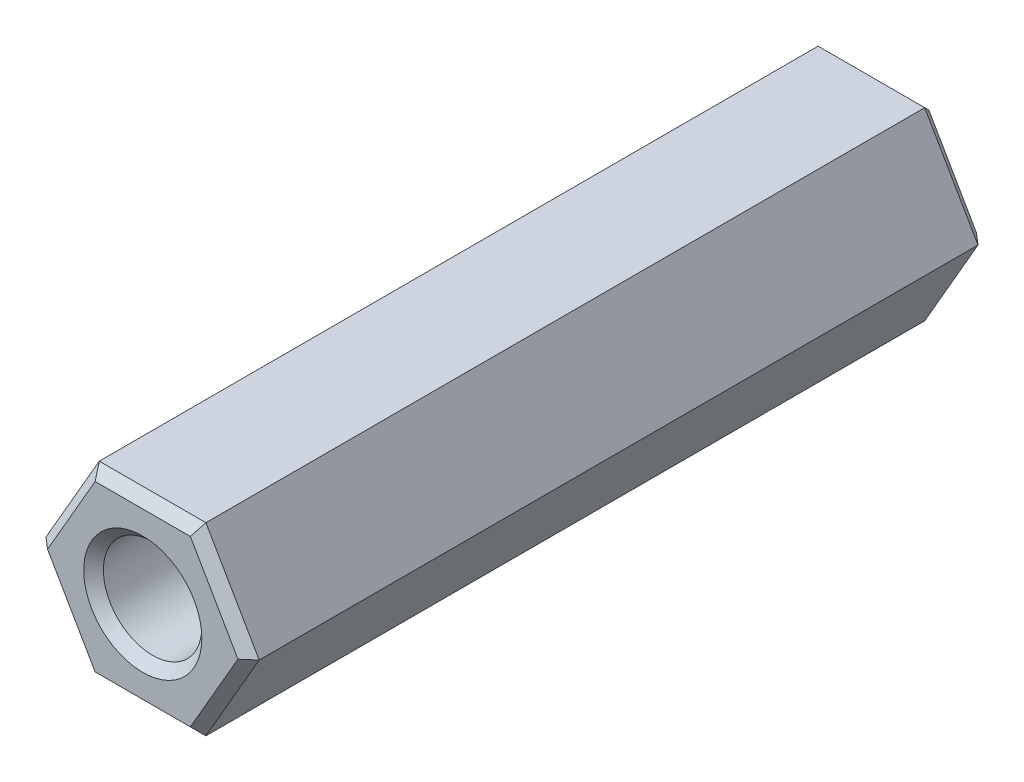
ISO-10303-21;
HEADER;
FILE_DESCRIPTION(('STEP AP214'),'2;1');
FILE_NAME('part.step','',(''),(''),'','','');
FILE_SCHEMA(('AUTOMOTIVE_DESIGN { 1 0 10303 214 1 1 1 1 }'));
ENDSEC;
DATA;
#1=APPLICATION_CONTEXT('core data for automotive mechanical design processes');
#2=APPLICATION_PROTOCOL_DEFINITION('international standard','automotive_design',2000,#1);
#3=PRODUCT_CONTEXT('',#1,'mechanical');
#4=PRODUCT('Part','Part','',(#3));
#5=PRODUCT_RELATED_PRODUCT_CATEGORY('part','',(#4));
#6=PRODUCT_DEFINITION_FORMATION('','',#4);
#7=PRODUCT_DEFINITION_CONTEXT('part definition',#1,'design');
#8=PRODUCT_DEFINITION('design','',#6,#7);
#9=PRODUCT_DEFINITION_SHAPE('','',#8);
#10=(LENGTH_UNIT() NAMED_UNIT(*) SI_UNIT(.MILLI.,.METRE.));
#11=(NAMED_UNIT(*) PLANE_ANGLE_UNIT() SI_UNIT($,.RADIAN.));
#12=(NAMED_UNIT(*) SI_UNIT($,.STERADIAN.) SOLID_ANGLE_UNIT());
#13=UNCERTAINTY_MEASURE_WITH_UNIT(LENGTH_MEASURE(1.E-05),#10,'distance_accuracy_value','');
#14=(GEOMETRIC_REPRESENTATION_CONTEXT(3) GLOBAL_UNCERTAINTY_ASSIGNED_CONTEXT((#13)) GLOBAL_UNIT_ASSIGNED_CONTEXT((#10,
#11,#12)) REPRESENTATION_CONTEXT('',''));
#15=CARTESIAN_POINT('',(0.,0.,0.));
#16=DIRECTION('',(0.,0.,1.));
#17=DIRECTION('',(1.,0.,0.));
#18=AXIS2_PLACEMENT_3D('',#15,#16,#17);
#19=CARTESIAN_POINT('',(-1.3748153285078,2.38125,-19.05));
#20=DIRECTION('',(-0.866025403784439,0.5,0.));
#21=DIRECTION('',(-0.5,-0.866025403784439,0.));
#22=AXIS2_PLACEMENT_3D('',#19,#20,#21);
#23=PLANE('',#22);
#24=DIRECTION('',(0.,0.,1.));
#25=VECTOR('',#24,1.);
#26=CARTESIAN_POINT('',(-2.74963065701559,0.,-19.05));
#27=LINE('',#26,#25);
#28=CARTESIAN_POINT('',(-2.7496306570156,0.,-0.254000000000016));
#29=VERTEX_POINT('',#28);
#30=CARTESIAN_POINT('',(-2.74963065701559,0.,-18.796));
#31=VERTEX_POINT('',#30);
#32=EDGE_CURVE('E134',#29,#31,#27,.F.);
#33=ORIENTED_EDGE('',*,*,#32,.F.);
#34=DIRECTION('',(0.499999999999999,0.866025403784439,0.));
#35=VECTOR('',#34,1.);
#36=CARTESIAN_POINT('',(-2.7496306570156,0.,-0.254000000000008));
#37=LINE('',#36,#35);
#38=CARTESIAN_POINT('',(-1.3748153285078,2.38125,-0.254000000000016));
#39=VERTEX_POINT('',#38);
#40=EDGE_CURVE('E104',#29,#39,#37,.T.);
#41=ORIENTED_EDGE('',*,*,#40,.T.);
#42=DIRECTION('',(0.,0.,1.));
#43=VECTOR('',#42,1.);
#44=CARTESIAN_POINT('',(-1.3748153285078,2.38125,-19.05));
#45=LINE('',#44,#43);
#46=CARTESIAN_POINT('',(-1.3748153285078,2.38125,-18.796));
#47=VERTEX_POINT('',#46);
#48=EDGE_CURVE('E111',#47,#39,#45,.T.);
#49=ORIENTED_EDGE('',*,*,#48,.F.);
#50=DIRECTION('',(0.499999999999999,0.866025403784439,0.));
#51=VECTOR('',#50,1.);
#52=CARTESIAN_POINT('',(-2.74963065701559,0.,-18.796));
#53=LINE('',#52,#51);
#54=EDGE_CURVE('E210',#31,#47,#53,.T.);
#55=ORIENTED_EDGE('',*,*,#54,.F.);
#56=EDGE_LOOP('',(#33,#41,#49,#55));
#57=FACE_BOUND('',#56,.T.);
#58=ADVANCED_FACE('F16',(#57),#23,.T.);
#59=CARTESIAN_POINT('',(-2.74963065701559,0.,-19.05));
#60=DIRECTION('',(-0.866025403784439,-0.5,0.));
#61=DIRECTION('',(0.5,-0.866025403784439,0.));
#62=AXIS2_PLACEMENT_3D('',#59,#60,#61);
#63=PLANE('',#62);
#64=DIRECTION('',(0.,0.,1.));
#65=VECTOR('',#64,1.);
#66=CARTESIAN_POINT('',(-1.3748153285078,-2.38125,-19.05));
#67=LINE('',#66,#65);
#68=CARTESIAN_POINT('',(-1.3748153285078,-2.38125,-0.254000000000016));
#69=VERTEX_POINT('',#68);
#70=CARTESIAN_POINT('',(-1.3748153285078,-2.38125,-18.796));
#71=VERTEX_POINT('',#70);
#72=EDGE_CURVE('E144',#69,#71,#67,.F.);
#73=ORIENTED_EDGE('',*,*,#72,.F.);
#74=DIRECTION('',(-0.499999999999999,0.866025403784439,0.));
#75=VECTOR('',#74,1.);
#76=CARTESIAN_POINT('',(-1.3748153285078,-2.38125,-0.254000000000011));
#77=LINE('',#76,#75);
#78=EDGE_CURVE('E132',#69,#29,#77,.T.);
#79=ORIENTED_EDGE('',*,*,#78,.T.);
#80=ORIENTED_EDGE('',*,*,#32,.T.);
#81=DIRECTION('',(-0.499999999999999,0.866025403784439,0.));
#82=VECTOR('',#81,1.);
#83=CARTESIAN_POINT('',(-1.3748153285078,-2.38125,-18.796));
#84=LINE('',#83,#82);
#85=EDGE_CURVE('E205',#71,#31,#84,.T.);
#86=ORIENTED_EDGE('',*,*,#85,.F.);
#87=EDGE_LOOP('',(#73,#79,#80,#86));
#88=FACE_BOUND('',#87,.T.);
#89=ADVANCED_FACE('F235',(#88),#63,.T.);
#90=CARTESIAN_POINT('',(-1.3748153285078,-2.38125,-19.05));
#91=DIRECTION('',(0.,-1.,0.));
#92=DIRECTION('',(1.,0.,0.));
#93=AXIS2_PLACEMENT_3D('',#90,#91,#92);
#94=PLANE('',#93);
#95=DIRECTION('',(0.,0.,1.));
#96=VECTOR('',#95,1.);
#97=CARTESIAN_POINT('',(1.3748153285078,-2.38125,-19.05));
#98=LINE('',#97,#96);
#99=CARTESIAN_POINT('',(1.3748153285078,-2.38125,-0.254000000000016));
#100=VERTEX_POINT('',#99);
#101=CARTESIAN_POINT('',(1.3748153285078,-2.38125,-18.796));
#102=VERTEX_POINT('',#101);
#103=EDGE_CURVE('E142',#100,#102,#98,.F.);
#104=ORIENTED_EDGE('',*,*,#103,.F.);
#105=DIRECTION('',(1.,0.,0.));
#106=VECTOR('',#105,1.);
#107=CARTESIAN_POINT('',(2.74963065701559,-2.38125000000001,-0.25400000000001));
#108=LINE('',#107,#106);
#109=EDGE_CURVE('E228',#100,#69,#108,.F.);
#110=ORIENTED_EDGE('',*,*,#109,.T.);
#111=ORIENTED_EDGE('',*,*,#72,.T.);
#112=DIRECTION('',(1.,0.,0.));
#113=VECTOR('',#112,1.);
#114=CARTESIAN_POINT('',(-1.3748153285078,-2.38125,-18.796));
#115=LINE('',#114,#113);
#116=EDGE_CURVE('E200',#102,#71,#115,.F.);
#117=ORIENTED_EDGE('',*,*,#116,.F.);
#118=EDGE_LOOP('',(#104,#110,#111,#117));
#119=FACE_BOUND('',#118,.T.);
#120=ADVANCED_FACE('F270',(#119),#94,.T.);
#121=CARTESIAN_POINT('',(1.3748153285078,-2.38125,-19.05));
#122=DIRECTION('',(0.866025403784439,-0.5,0.));
#123=DIRECTION('',(0.5,0.866025403784439,0.));
#124=AXIS2_PLACEMENT_3D('',#121,#122,#123);
#125=PLANE('',#124);
#126=DIRECTION('',(0.,0.,1.));
#127=VECTOR('',#126,1.);
#128=CARTESIAN_POINT('',(2.74963065701559,0.,-19.05));
#129=LINE('',#128,#127);
#130=CARTESIAN_POINT('',(2.7496306570156,0.,-0.254000000000016));
#131=VERTEX_POINT('',#130);
#132=CARTESIAN_POINT('',(2.74963065701559,0.,-18.796));
#133=VERTEX_POINT('',#132);
#134=EDGE_CURVE('E140',#131,#133,#129,.F.);
#135=ORIENTED_EDGE('',*,*,#134,.F.);
#136=DIRECTION('',(-0.499999999999999,-0.866025403784439,0.));
#137=VECTOR('',#136,1.);
#138=CARTESIAN_POINT('',(2.7496306570156,0.,-0.254000000000008));
#139=LINE('',#138,#137);
#140=EDGE_CURVE('E222',#131,#100,#139,.T.);
#141=ORIENTED_EDGE('',*,*,#140,.T.);
#142=ORIENTED_EDGE('',*,*,#103,.T.);
#143=DIRECTION('',(-0.499999999999999,-0.866025403784439,0.));
#144=VECTOR('',#143,1.);
#145=CARTESIAN_POINT('',(2.74963065701559,0.,-18.796));
#146=LINE('',#145,#144);
#147=EDGE_CURVE('E195',#133,#102,#146,.T.);
#148=ORIENTED_EDGE('',*,*,#147,.F.);
#149=EDGE_LOOP('',(#135,#141,#142,#148));
#150=FACE_BOUND('',#149,.T.);
#151=ADVANCED_FACE('F277',(#150),#125,.T.);
#152=CARTESIAN_POINT('',(2.74963065701559,0.,-19.05));
#153=DIRECTION('',(0.866025403784439,0.5,0.));
#154=DIRECTION('',(-0.5,0.866025403784439,0.));
#155=AXIS2_PLACEMENT_3D('',#152,#153,#154);
#156=PLANE('',#155);
#157=DIRECTION('',(0.,0.,1.));
#158=VECTOR('',#157,1.);
#159=CARTESIAN_POINT('',(1.3748153285078,2.38125,-19.05));
#160=LINE('',#159,#158);
#161=CARTESIAN_POINT('',(1.3748153285078,2.38125,-0.254000000000015));
#162=VERTEX_POINT('',#161);
#163=CARTESIAN_POINT('',(1.3748153285078,2.38125,-18.796));
#164=VERTEX_POINT('',#163);
#165=EDGE_CURVE('E119',#162,#164,#160,.F.);
#166=ORIENTED_EDGE('',*,*,#165,.F.);
#167=DIRECTION('',(0.499999999999999,-0.866025403784439,0.));
#168=VECTOR('',#167,1.);
#169=CARTESIAN_POINT('',(1.37481532850781,2.38125000000001,-0.25400000000001));
#170=LINE('',#169,#168);
#171=EDGE_CURVE('E215',#162,#131,#170,.T.);
#172=ORIENTED_EDGE('',*,*,#171,.T.);
#173=ORIENTED_EDGE('',*,*,#134,.T.);
#174=DIRECTION('',(0.499999999999999,-0.866025403784439,0.));
#175=VECTOR('',#174,1.);
#176=CARTESIAN_POINT('',(1.3748153285078,2.38125,-18.796));
#177=LINE('',#176,#175);
#178=EDGE_CURVE('E190',#164,#133,#177,.T.);
#179=ORIENTED_EDGE('',*,*,#178,.F.);
#180=EDGE_LOOP('',(#166,#172,#173,#179));
#181=FACE_BOUND('',#180,.T.);
#182=ADVANCED_FACE('F250',(#181),#156,.T.);
#183=CARTESIAN_POINT('',(1.3748153285078,2.38125,-19.05));
#184=DIRECTION('',(0.,1.,0.));
#185=DIRECTION('',(-1.,0.,0.));
#186=AXIS2_PLACEMENT_3D('',#183,#184,#185);
#187=PLANE('',#186);
#188=ORIENTED_EDGE('',*,*,#48,.T.);
#189=DIRECTION('',(1.,0.,0.));
#190=VECTOR('',#189,1.);
#191=CARTESIAN_POINT('',(2.74963065701559,2.38125000000001,-0.254000000000011));
#192=LINE('',#191,#190);
#193=EDGE_CURVE('E114',#39,#162,#192,.T.);
#194=ORIENTED_EDGE('',*,*,#193,.T.);
#195=ORIENTED_EDGE('',*,*,#165,.T.);
#196=DIRECTION('',(1.,0.,0.));
#197=VECTOR('',#196,1.);
#198=CARTESIAN_POINT('',(1.3748153285078,2.38125,-18.796));
#199=LINE('',#198,#197);
#200=EDGE_CURVE('E116',#47,#164,#199,.T.);
#201=ORIENTED_EDGE('',*,*,#200,.F.);
#202=EDGE_LOOP('',(#188,#194,#195,#201));
#203=FACE_BOUND('',#202,.T.);
#204=ADVANCED_FACE('F113',(#203),#187,.T.);
#205=CARTESIAN_POINT('',(2.74963065701559,2.12725,0.));
#206=DIRECTION('',(0.,-0.707106781186545,-0.70710678118655));
#207=DIRECTION('',(0.,0.70710678118655,-0.707106781186545));
#208=AXIS2_PLACEMENT_3D('',#205,#206,#207);
#209=PLANE('',#208);
#210=ORIENTED_EDGE('',*,*,#193,.F.);
#211=DIRECTION('',(0.377964473009244,-0.654653670707966,0.654653670707979));
#212=VECTOR('',#211,1.);
#213=CARTESIAN_POINT('',(-1.37481532850781,2.38125000000001,-0.25400000000001));
#214=LINE('',#213,#212);
#215=CARTESIAN_POINT('',(-1.22816836013363,2.12725,0.));
#216=VERTEX_POINT('',#215);
#217=EDGE_CURVE('E126',#39,#216,#214,.T.);
#218=ORIENTED_EDGE('',*,*,#217,.T.);
#219=DIRECTION('',(1.,0.,0.));
#220=VECTOR('',#219,1.);
#221=CARTESIAN_POINT('',(2.74963065701559,2.12725,0.));
#222=LINE('',#221,#220);
#223=CARTESIAN_POINT('',(1.22816836013363,2.12725,0.));
#224=VERTEX_POINT('',#223);
#225=EDGE_CURVE('E184',#224,#216,#222,.F.);
#226=ORIENTED_EDGE('',*,*,#225,.F.);
#227=DIRECTION('',(0.377964473009236,0.654653670707973,-0.654653670707977));
#228=VECTOR('',#227,1.);
#229=CARTESIAN_POINT('',(1.22816836013363,2.12725,0.));
#230=LINE('',#229,#228);
#231=EDGE_CURVE('E128',#224,#162,#230,.T.);
#232=ORIENTED_EDGE('',*,*,#231,.T.);
#233=EDGE_LOOP('',(#210,#218,#226,#232));
#234=FACE_BOUND('',#233,.T.);
#235=ADVANCED_FACE('F124',(#234),#209,.F.);
#236=CARTESIAN_POINT('',(-1.15484487594655,2.25425,0.));
#237=DIRECTION('',(0.612372435695792,-0.353553390593272,-0.707106781186551));
#238=DIRECTION('',(-0.755928946018458,0.,-0.654653670707974));
#239=AXIS2_PLACEMENT_3D('',#236,#237,#238);
#240=PLANE('',#239);
#241=ORIENTED_EDGE('',*,*,#40,.F.);
#242=DIRECTION('',(-0.755928946018456,0.,-0.654653670707976));
#243=VECTOR('',#242,1.);
#244=CARTESIAN_POINT('',(-1.71262709494113,0.,0.644071428571427));
#245=LINE('',#244,#243);
#246=CARTESIAN_POINT('',(-2.45633672026726,0.,0.));
#247=VERTEX_POINT('',#246);
#248=EDGE_CURVE('E231',#29,#247,#245,.F.);
#249=ORIENTED_EDGE('',*,*,#248,.T.);
#250=DIRECTION('',(-0.500000000000001,-0.866025403784438,0.));
#251=VECTOR('',#250,1.);
#252=CARTESIAN_POINT('',(-1.22816836013363,2.12725,0.));
#253=LINE('',#252,#251);
#254=EDGE_CURVE('E131',#216,#247,#253,.T.);
#255=ORIENTED_EDGE('',*,*,#254,.F.);
#256=ORIENTED_EDGE('',*,*,#217,.F.);
#257=EDGE_LOOP('',(#241,#249,#255,#256));
#258=FACE_BOUND('',#257,.T.);
#259=ADVANCED_FACE('F130',(#258),#240,.F.);
#260=CARTESIAN_POINT('',(-1.15484487594655,-2.25425,0.));
#261=DIRECTION('',(0.612372435695793,0.353553390593273,-0.707106781186549));
#262=DIRECTION('',(-0.755928946018456,0.,-0.654653670707976));
#263=AXIS2_PLACEMENT_3D('',#260,#261,#262);
#264=PLANE('',#263);
#265=DIRECTION('',(0.499999999999999,-0.866025403784439,0.));
#266=VECTOR('',#265,1.);
#267=CARTESIAN_POINT('',(-2.45633672026726,0.,0.));
#268=LINE('',#267,#266);
#269=CARTESIAN_POINT('',(-1.22816836013363,-2.12725,0.));
#270=VERTEX_POINT('',#269);
#271=EDGE_CURVE('E181',#247,#270,#268,.T.);
#272=ORIENTED_EDGE('',*,*,#271,.F.);
#273=ORIENTED_EDGE('',*,*,#248,.F.);
#274=ORIENTED_EDGE('',*,*,#78,.F.);
#275=DIRECTION('',(0.377964473009215,0.654653670707983,0.654653670707978));
#276=VECTOR('',#275,1.);
#277=CARTESIAN_POINT('',(-1.3748153285078,-2.38125000000001,-0.254000000000011));
#278=LINE('',#277,#276);
#279=EDGE_CURVE('E225',#69,#270,#278,.T.);
#280=ORIENTED_EDGE('',*,*,#279,.T.);
#281=EDGE_LOOP('',(#272,#273,#274,#280));
#282=FACE_BOUND('',#281,.T.);
#283=ADVANCED_FACE('F240',(#282),#264,.F.);
#284=CARTESIAN_POINT('',(2.74963065701559,-2.12725,0.));
#285=DIRECTION('',(0.,0.707106781186545,-0.70710678118655));
#286=DIRECTION('',(0.,0.70710678118655,0.707106781186545));
#287=AXIS2_PLACEMENT_3D('',#284,#285,#286);
#288=PLANE('',#287);
#289=DIRECTION('',(1.,0.,0.));
#290=VECTOR('',#289,1.);
#291=CARTESIAN_POINT('',(2.74963065701559,-2.12725,0.));
#292=LINE('',#291,#290);
#293=CARTESIAN_POINT('',(1.22816836013363,-2.12725,0.));
#294=VERTEX_POINT('',#293);
#295=EDGE_CURVE('E179',#270,#294,#292,.T.);
#296=ORIENTED_EDGE('',*,*,#295,.F.);
#297=ORIENTED_EDGE('',*,*,#279,.F.);
#298=ORIENTED_EDGE('',*,*,#109,.F.);
#299=DIRECTION('',(-0.377964473009243,0.654653670707965,0.65465367070798));
#300=VECTOR('',#299,1.);
#301=CARTESIAN_POINT('',(1.37481532850781,-2.38125000000001,-0.254000000000009));
#302=LINE('',#301,#300);
#303=EDGE_CURVE('E219',#100,#294,#302,.T.);
#304=ORIENTED_EDGE('',*,*,#303,.T.);
#305=EDGE_LOOP('',(#296,#297,#298,#304));
#306=FACE_BOUND('',#305,.T.);
#307=ADVANCED_FACE('F397',(#306),#288,.F.);
#308=CARTESIAN_POINT('',(2.52966020445435,0.127000000000002,0.));
#309=DIRECTION('',(-0.612372435695792,0.353553390593272,-0.70710678118655));
#310=DIRECTION('',(-0.755928946018457,0.,0.654653670707974));
#311=AXIS2_PLACEMENT_3D('',#308,#309,#310);
#312=PLANE('',#311);
#313=ORIENTED_EDGE('',*,*,#140,.F.);
#314=DIRECTION('',(-0.755928946018457,0.,0.654653670707974));
#315=VECTOR('',#314,1.);
#316=CARTESIAN_POINT('',(2.49823585408845,0.,-0.0362857142857163));
#317=LINE('',#316,#315);
#318=CARTESIAN_POINT('',(2.45633672026726,0.,0.));
#319=VERTEX_POINT('',#318);
#320=EDGE_CURVE('E211',#131,#319,#317,.T.);
#321=ORIENTED_EDGE('',*,*,#320,.T.);
#322=DIRECTION('',(0.500000000000001,0.866025403784438,0.));
#323=VECTOR('',#322,1.);
#324=CARTESIAN_POINT('',(1.22816836013363,-2.12725,0.));
#325=LINE('',#324,#323);
#326=EDGE_CURVE('E177',#294,#319,#325,.T.);
#327=ORIENTED_EDGE('',*,*,#326,.F.);
#328=ORIENTED_EDGE('',*,*,#303,.F.);
#329=EDGE_LOOP('',(#313,#321,#327,#328));
#330=FACE_BOUND('',#329,.T.);
#331=ADVANCED_FACE('F388',(#330),#312,.F.);
#332=CARTESIAN_POINT('',(2.52966020445435,-0.127000000000002,0.));
#333=DIRECTION('',(-0.612372435695792,-0.353553390593272,-0.70710678118655));
#334=DIRECTION('',(-0.755928946018457,0.,0.654653670707974));
#335=AXIS2_PLACEMENT_3D('',#332,#333,#334);
#336=PLANE('',#335);
#337=ORIENTED_EDGE('',*,*,#171,.F.);
#338=ORIENTED_EDGE('',*,*,#231,.F.);
#339=DIRECTION('',(-0.499999999999999,0.866025403784439,0.));
#340=VECTOR('',#339,1.);
#341=CARTESIAN_POINT('',(2.45633672026726,0.,0.));
#342=LINE('',#341,#340);
#343=EDGE_CURVE('E174',#319,#224,#342,.T.);
#344=ORIENTED_EDGE('',*,*,#343,.F.);
#345=ORIENTED_EDGE('',*,*,#320,.F.);
#346=EDGE_LOOP('',(#337,#338,#344,#345));
#347=FACE_BOUND('',#346,.T.);
#348=ADVANCED_FACE('F248',(#347),#336,.F.);
#349=CARTESIAN_POINT('',(-1.3748153285078,2.38125,-18.796));
#350=DIRECTION('',(-0.612372435695798,0.353553390593276,-0.707106781186543));
#351=DIRECTION('',(-0.755928946018451,0.,0.654653670707982));
#352=AXIS2_PLACEMENT_3D('',#349,#350,#351);
#353=PLANE('',#352);
#354=DIRECTION('',(-0.37796447300924,0.654653670707971,0.654653670707976));
#355=VECTOR('',#354,1.);
#356=CARTESIAN_POINT('',(-1.22816836013363,2.12725,-19.05));
#357=LINE('',#356,#355);
#358=CARTESIAN_POINT('',(-1.22816836013363,2.12725,-19.05));
#359=VERTEX_POINT('',#358);
#360=EDGE_CURVE('E188',#359,#47,#357,.T.);
#361=ORIENTED_EDGE('',*,*,#360,.F.);
#362=DIRECTION('',(-0.500000000000001,-0.866025403784438,0.));
#363=VECTOR('',#362,1.);
#364=CARTESIAN_POINT('',(-1.22816836013363,2.12725,-19.05));
#365=LINE('',#364,#363);
#366=CARTESIAN_POINT('',(-2.45633672026726,0.,-19.05));
#367=VERTEX_POINT('',#366);
#368=EDGE_CURVE('E171',#359,#367,#365,.T.);
#369=ORIENTED_EDGE('',*,*,#368,.T.);
#370=DIRECTION('',(-0.755928946018451,0.,0.654653670707981));
#371=VECTOR('',#370,1.);
#372=CARTESIAN_POINT('',(-2.74963065701559,0.,-18.796));
#373=LINE('',#372,#371);
#374=EDGE_CURVE('E208',#31,#367,#373,.F.);
#375=ORIENTED_EDGE('',*,*,#374,.F.);
#376=ORIENTED_EDGE('',*,*,#54,.T.);
#377=EDGE_LOOP('',(#361,#369,#375,#376));
#378=FACE_BOUND('',#377,.T.);
#379=ADVANCED_FACE('F257',(#378),#353,.T.);
#380=CARTESIAN_POINT('',(-2.74963065701559,0.,-18.796));
#381=DIRECTION('',(-0.612372435695798,-0.353553390593276,-0.707106781186544));
#382=DIRECTION('',(-0.755928946018451,0.,0.654653670707981));
#383=AXIS2_PLACEMENT_3D('',#380,#381,#382);
#384=PLANE('',#383);
#385=DIRECTION('',(0.37796447300924,0.654653670707971,-0.654653670707976));
#386=VECTOR('',#385,1.);
#387=CARTESIAN_POINT('',(-1.3748153285078,-2.38125,-18.796));
#388=LINE('',#387,#386);
#389=CARTESIAN_POINT('',(-1.22816836013363,-2.12725,-19.05));
#390=VERTEX_POINT('',#389);
#391=EDGE_CURVE('E203',#71,#390,#388,.T.);
#392=ORIENTED_EDGE('',*,*,#391,.F.);
#393=ORIENTED_EDGE('',*,*,#85,.T.);
#394=ORIENTED_EDGE('',*,*,#374,.T.);
#395=DIRECTION('',(0.500000000000001,-0.866025403784438,0.));
#396=VECTOR('',#395,1.);
#397=CARTESIAN_POINT('',(-2.45633672026726,0.,-19.05));
#398=LINE('',#397,#396);
#399=EDGE_CURVE('E168',#367,#390,#398,.T.);
#400=ORIENTED_EDGE('',*,*,#399,.T.);
#401=EDGE_LOOP('',(#392,#393,#394,#400));
#402=FACE_BOUND('',#401,.T.);
#403=ADVANCED_FACE('F261',(#402),#384,.T.);
#404=CARTESIAN_POINT('',(-1.3748153285078,-2.38125,-18.796));
#405=DIRECTION('',(0.,-0.707106781186551,-0.707106781186544));
#406=DIRECTION('',(0.,0.707106781186544,-0.707106781186551));
#407=AXIS2_PLACEMENT_3D('',#404,#405,#406);
#408=PLANE('',#407);
#409=DIRECTION('',(-0.377964473009231,0.654653670707969,-0.654653670707983));
#410=VECTOR('',#409,1.);
#411=CARTESIAN_POINT('',(1.3748153285078,-2.38125,-18.796));
#412=LINE('',#411,#410);
#413=CARTESIAN_POINT('',(1.22816836013363,-2.12725,-19.05));
#414=VERTEX_POINT('',#413);
#415=EDGE_CURVE('E198',#102,#414,#412,.T.);
#416=ORIENTED_EDGE('',*,*,#415,.F.);
#417=ORIENTED_EDGE('',*,*,#116,.T.);
#418=ORIENTED_EDGE('',*,*,#391,.T.);
#419=DIRECTION('',(1.,0.,0.));
#420=VECTOR('',#419,1.);
#421=CARTESIAN_POINT('',(2.74963065701559,-2.12725,-19.05));
#422=LINE('',#421,#420);
#423=EDGE_CURVE('E165',#390,#414,#422,.T.);
#424=ORIENTED_EDGE('',*,*,#423,.T.);
#425=EDGE_LOOP('',(#416,#417,#418,#424));
#426=FACE_BOUND('',#425,.T.);
#427=ADVANCED_FACE('F266',(#426),#408,.T.);
#428=CARTESIAN_POINT('',(1.3748153285078,-2.38125,-18.796));
#429=DIRECTION('',(0.612372435695798,-0.353553390593275,-0.707106781186544));
#430=DIRECTION('',(-0.755928946018451,0.,-0.654653670707981));
#431=AXIS2_PLACEMENT_3D('',#428,#429,#430);
#432=PLANE('',#431);
#433=DIRECTION('',(-0.755928946018452,0.,-0.65465367070798));
#434=VECTOR('',#433,1.);
#435=CARTESIAN_POINT('',(2.74963065701559,0.,-18.796));
#436=LINE('',#435,#434);
#437=CARTESIAN_POINT('',(2.45633672026726,0.,-19.05));
#438=VERTEX_POINT('',#437);
#439=EDGE_CURVE('E193',#133,#438,#436,.T.);
#440=ORIENTED_EDGE('',*,*,#439,.F.);
#441=ORIENTED_EDGE('',*,*,#147,.T.);
#442=ORIENTED_EDGE('',*,*,#415,.T.);
#443=DIRECTION('',(0.500000000000001,0.866025403784438,0.));
#444=VECTOR('',#443,1.);
#445=CARTESIAN_POINT('',(1.22816836013363,-2.12725,-19.05));
#446=LINE('',#445,#444);
#447=EDGE_CURVE('E160',#414,#438,#446,.T.);
#448=ORIENTED_EDGE('',*,*,#447,.T.);
#449=EDGE_LOOP('',(#440,#441,#442,#448));
#450=FACE_BOUND('',#449,.T.);
#451=ADVANCED_FACE('F274',(#450),#432,.T.);
#452=CARTESIAN_POINT('',(2.74963065701559,0.,-18.796));
#453=DIRECTION('',(0.612372435695797,0.353553390593275,-0.707106781186545));
#454=DIRECTION('',(-0.755928946018452,0.,-0.65465367070798));
#455=AXIS2_PLACEMENT_3D('',#452,#453,#454);
#456=PLANE('',#455);
#457=DIRECTION('',(-0.377964473009241,-0.654653670707971,-0.654653670707976));
#458=VECTOR('',#457,1.);
#459=CARTESIAN_POINT('',(1.3748153285078,2.38125,-18.796));
#460=LINE('',#459,#458);
#461=CARTESIAN_POINT('',(1.22816836013363,2.12725,-19.05));
#462=VERTEX_POINT('',#461);
#463=EDGE_CURVE('E34',#164,#462,#460,.T.);
#464=ORIENTED_EDGE('',*,*,#463,.F.);
#465=ORIENTED_EDGE('',*,*,#178,.T.);
#466=ORIENTED_EDGE('',*,*,#439,.T.);
#467=DIRECTION('',(-0.500000000000001,0.866025403784438,0.));
#468=VECTOR('',#467,1.);
#469=CARTESIAN_POINT('',(2.45633672026726,0.,-19.05));
#470=LINE('',#469,#468);
#471=EDGE_CURVE('E156',#438,#462,#470,.T.);
#472=ORIENTED_EDGE('',*,*,#471,.T.);
#473=EDGE_LOOP('',(#464,#465,#466,#472));
#474=FACE_BOUND('',#473,.T.);
#475=ADVANCED_FACE('F279',(#474),#456,.T.);
#476=CARTESIAN_POINT('',(1.3748153285078,2.38125,-18.796));
#477=DIRECTION('',(0.,0.707106781186552,-0.707106781186544));
#478=DIRECTION('',(0.,0.707106781186544,0.707106781186552));
#479=AXIS2_PLACEMENT_3D('',#476,#477,#478);
#480=PLANE('',#479);
#481=ORIENTED_EDGE('',*,*,#463,.T.);
#482=DIRECTION('',(1.,0.,0.));
#483=VECTOR('',#482,1.);
#484=CARTESIAN_POINT('',(2.74963065701559,2.12725,-19.05));
#485=LINE('',#484,#483);
#486=EDGE_CURVE('E153',#462,#359,#485,.F.);
#487=ORIENTED_EDGE('',*,*,#486,.T.);
#488=ORIENTED_EDGE('',*,*,#360,.T.);
#489=ORIENTED_EDGE('',*,*,#200,.T.);
#490=EDGE_LOOP('',(#481,#487,#488,#489));
#491=FACE_BOUND('',#490,.T.);
#492=ADVANCED_FACE('F254',(#491),#480,.T.);
#493=CARTESIAN_POINT('',(2.74963065701559,0.,0.));
#494=DIRECTION('',(0.,0.,1.));
#495=DIRECTION('',(1.,0.,0.));
#496=AXIS2_PLACEMENT_3D('',#493,#494,#495);
#497=PLANE('',#496);
#498=ORIENTED_EDGE('',*,*,#326,.T.);
#499=ORIENTED_EDGE('',*,*,#343,.T.);
#500=ORIENTED_EDGE('',*,*,#225,.T.);
#501=ORIENTED_EDGE('',*,*,#254,.T.);
#502=ORIENTED_EDGE('',*,*,#271,.T.);
#503=ORIENTED_EDGE('',*,*,#295,.T.);
#504=EDGE_LOOP('',(#498,#499,#500,#501,#502,#503));
#505=FACE_BOUND('',#504,.T.);
#506=CARTESIAN_POINT('',(0.,0.,0.));
#507=DIRECTION('',(0.,0.,1.));
#508=DIRECTION('',(1.,0.,0.));
#509=AXIS2_PLACEMENT_3D('',#506,#507,#508);
#510=CIRCLE('',#509,1.52400000001762);
#511=CARTESIAN_POINT('',(1.52400000001762,0.,0.));
#512=VERTEX_POINT('',#511);
#513=EDGE_CURVE('E19',#512,#512,#510,.F.);
#514=ORIENTED_EDGE('',*,*,#513,.T.);
#515=EDGE_LOOP('',(#514));
#516=FACE_BOUND('',#515,.T.);
#517=ADVANCED_FACE('F243',(#505,#516),#497,.T.);
#518=CARTESIAN_POINT('',(2.74963065701559,0.,-19.05));
#519=DIRECTION('',(0.,0.,1.));
#520=DIRECTION('',(1.,0.,0.));
#521=AXIS2_PLACEMENT_3D('',#518,#519,#520);
#522=PLANE('',#521);
#523=CARTESIAN_POINT('',(0.,0.,-19.0499999999929));
#524=DIRECTION('',(0.,0.,-1.));
#525=DIRECTION('',(-1.,0.,0.));
#526=AXIS2_PLACEMENT_3D('',#523,#524,#525);
#527=CIRCLE('',#526,1.52400000001762);
#528=CARTESIAN_POINT('',(-1.52400000001762,0.,-19.0499999999929));
#529=VERTEX_POINT('',#528);
#530=EDGE_CURVE('E146',#529,#529,#527,.F.);
#531=ORIENTED_EDGE('',*,*,#530,.T.);
#532=EDGE_LOOP('',(#531));
#533=FACE_BOUND('',#532,.T.);
#534=ORIENTED_EDGE('',*,*,#471,.F.);
#535=ORIENTED_EDGE('',*,*,#447,.F.);
#536=ORIENTED_EDGE('',*,*,#423,.F.);
#537=ORIENTED_EDGE('',*,*,#399,.F.);
#538=ORIENTED_EDGE('',*,*,#368,.F.);
#539=ORIENTED_EDGE('',*,*,#486,.F.);
#540=EDGE_LOOP('',(#534,#535,#536,#537,#538,#539));
#541=FACE_BOUND('',#540,.T.);
#542=ADVANCED_FACE('F282',(#533,#541),#522,.F.);
#543=CARTESIAN_POINT('',(0.,0.,0.));
#544=DIRECTION('',(0.,0.,1.));
#545=DIRECTION('',(1.,0.,0.));
#546=AXIS2_PLACEMENT_3D('',#543,#544,#545);
#547=CONICAL_SURFACE('',#546,1.52400000001762,0.785398163397448);
#548=ORIENTED_EDGE('',*,*,#513,.F.);
#549=EDGE_LOOP('',(#548));
#550=FACE_BOUND('',#549,.T.);
#551=CARTESIAN_POINT('',(0.,0.,-0.254000000000018));
#552=DIRECTION('',(0.,0.,1.));
#553=DIRECTION('',(1.,0.,0.));
#554=AXIS2_PLACEMENT_3D('',#551,#552,#553);
#555=CIRCLE('',#554,1.27);
#556=CARTESIAN_POINT('',(1.27,0.,-0.254000000000018));
#557=VERTEX_POINT('',#556);
#558=EDGE_CURVE('E25',#557,#557,#555,.F.);
#559=ORIENTED_EDGE('',*,*,#558,.T.);
#560=EDGE_LOOP('',(#559));
#561=FACE_BOUND('',#560,.T.);
#562=ADVANCED_FACE('F284',(#550,#561),#547,.F.);
#563=CARTESIAN_POINT('',(0.,0.,-19.0499999998792));
#564=DIRECTION('',(0.,0.,-1.));
#565=DIRECTION('',(-1.,0.,0.));
#566=AXIS2_PLACEMENT_3D('',#563,#564,#565);
#567=CONICAL_SURFACE('',#566,1.52399999990394,0.785398163397448);
#568=CARTESIAN_POINT('',(0.,0.,-18.796));
#569=DIRECTION('',(0.,0.,1.));
#570=DIRECTION('',(1.,0.,0.));
#571=AXIS2_PLACEMENT_3D('',#568,#569,#570);
#572=CIRCLE('',#571,1.27);
#573=CARTESIAN_POINT('',(1.27,0.,-18.796));
#574=VERTEX_POINT('',#573);
#575=EDGE_CURVE('E11',#574,#574,#572,.T.);
#576=ORIENTED_EDGE('',*,*,#575,.T.);
#577=EDGE_LOOP('',(#576));
#578=FACE_BOUND('',#577,.T.);
#579=ORIENTED_EDGE('',*,*,#530,.F.);
#580=EDGE_LOOP('',(#579));
#581=FACE_BOUND('',#580,.T.);
#582=ADVANCED_FACE('F291',(#578,#581),#567,.F.);
#583=CARTESIAN_POINT('',(0.,0.,-19.05));
#584=DIRECTION('',(0.,0.,1.));
#585=DIRECTION('',(1.,0.,0.));
#586=AXIS2_PLACEMENT_3D('',#583,#584,#585);
#587=CYLINDRICAL_SURFACE('',#586,1.27);
#588=ORIENTED_EDGE('',*,*,#558,.F.);
#589=EDGE_LOOP('',(#588));
#590=FACE_BOUND('',#589,.T.);
#591=ORIENTED_EDGE('',*,*,#575,.F.);
#592=EDGE_LOOP('',(#591));
#593=FACE_BOUND('',#592,.T.);
#594=ADVANCED_FACE('F295',(#590,#593),#587,.F.);
#595=CLOSED_SHELL('',(#58,#89,#120,#151,#182,#204,#235,#259,#283,#307,#331,#348,#379,#403,#427,
#451,#475,#492,#517,#542,#562,#582,#594));
#596=MANIFOLD_SOLID_BREP('B1',#595);
#597=ADVANCED_BREP_SHAPE_REPRESENTATION('',(#18,#596),#14);
#598=SHAPE_DEFINITION_REPRESENTATION(#9,#597);
ENDSEC;
END-ISO-10303-21;
